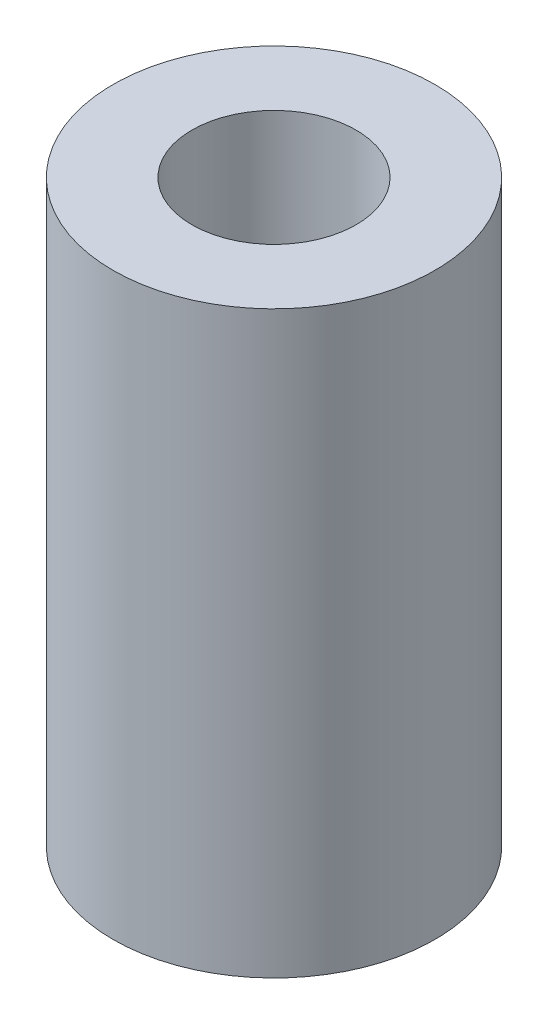
ISO-10303-21;
HEADER;
FILE_DESCRIPTION(('STEP AP214'),'2;1');
FILE_NAME('part.step','',(''),(''),'','','');
FILE_SCHEMA(('AUTOMOTIVE_DESIGN { 1 0 10303 214 1 1 1 1 }'));
ENDSEC;
DATA;
#1=APPLICATION_CONTEXT('core data for automotive mechanical design processes');
#2=APPLICATION_PROTOCOL_DEFINITION('international standard','automotive_design',2000,#1);
#3=PRODUCT_CONTEXT('',#1,'mechanical');
#4=PRODUCT('Part','Part','',(#3));
#5=PRODUCT_RELATED_PRODUCT_CATEGORY('part','',(#4));
#6=PRODUCT_DEFINITION_FORMATION('','',#4);
#7=PRODUCT_DEFINITION_CONTEXT('part definition',#1,'design');
#8=PRODUCT_DEFINITION('design','',#6,#7);
#9=PRODUCT_DEFINITION_SHAPE('','',#8);
#10=(LENGTH_UNIT() NAMED_UNIT(*) SI_UNIT(.MILLI.,.METRE.));
#11=(NAMED_UNIT(*) PLANE_ANGLE_UNIT() SI_UNIT($,.RADIAN.));
#12=(NAMED_UNIT(*) SI_UNIT($,.STERADIAN.) SOLID_ANGLE_UNIT());
#13=UNCERTAINTY_MEASURE_WITH_UNIT(LENGTH_MEASURE(1.E-05),#10,'distance_accuracy_value','');
#14=(GEOMETRIC_REPRESENTATION_CONTEXT(3) GLOBAL_UNCERTAINTY_ASSIGNED_CONTEXT((#13)) GLOBAL_UNIT_ASSIGNED_CONTEXT((#10,
#11,#12)) REPRESENTATION_CONTEXT('',''));
#15=CARTESIAN_POINT('',(0.,0.,0.));
#16=DIRECTION('',(0.,0.,1.));
#17=DIRECTION('',(1.,0.,0.));
#18=AXIS2_PLACEMENT_3D('',#15,#16,#17);
#19=CARTESIAN_POINT('',(0.,22.86,0.));
#20=DIRECTION('',(0.,-1.,0.));
#21=DIRECTION('',(0.,0.,-1.));
#22=AXIS2_PLACEMENT_3D('',#19,#20,#21);
#23=CYLINDRICAL_SURFACE('',#22,6.35);
#24=CARTESIAN_POINT('',(0.,22.86,0.));
#25=DIRECTION('',(0.,1.,0.));
#26=DIRECTION('',(0.,0.,1.));
#27=AXIS2_PLACEMENT_3D('',#24,#25,#26);
#28=CIRCLE('',#27,6.35);
#29=CARTESIAN_POINT('',(0.,22.86,6.35));
#30=VERTEX_POINT('',#29);
#31=EDGE_CURVE('E10',#30,#30,#28,.T.);
#32=ORIENTED_EDGE('',*,*,#31,.F.);
#33=EDGE_LOOP('',(#32));
#34=FACE_BOUND('',#33,.T.);
#35=CARTESIAN_POINT('',(0.,0.,0.));
#36=DIRECTION('',(0.,1.,0.));
#37=DIRECTION('',(0.,0.,1.));
#38=AXIS2_PLACEMENT_3D('',#35,#36,#37);
#39=CIRCLE('',#38,6.35);
#40=CARTESIAN_POINT('',(0.,0.,6.35));
#41=VERTEX_POINT('',#40);
#42=EDGE_CURVE('E36',#41,#41,#39,.T.);
#43=ORIENTED_EDGE('',*,*,#42,.T.);
#44=EDGE_LOOP('',(#43));
#45=FACE_BOUND('',#44,.T.);
#46=ADVANCED_FACE('F33',(#34,#45),#23,.T.);
#47=CARTESIAN_POINT('',(0.,22.86,0.));
#48=DIRECTION('',(0.,1.,0.));
#49=DIRECTION('',(0.,0.,1.));
#50=AXIS2_PLACEMENT_3D('',#47,#48,#49);
#51=PLANE('',#50);
#52=CARTESIAN_POINT('',(0.,22.86,0.));
#53=DIRECTION('',(0.,1.,0.));
#54=DIRECTION('',(0.,0.,1.));
#55=AXIS2_PLACEMENT_3D('',#52,#53,#54);
#56=CIRCLE('',#55,3.2385);
#57=CARTESIAN_POINT('',(0.,22.86,3.2385));
#58=VERTEX_POINT('',#57);
#59=EDGE_CURVE('E51',#58,#58,#56,.T.);
#60=ORIENTED_EDGE('',*,*,#59,.F.);
#61=EDGE_LOOP('',(#60));
#62=FACE_BOUND('',#61,.T.);
#63=ORIENTED_EDGE('',*,*,#31,.T.);
#64=EDGE_LOOP('',(#63));
#65=FACE_BOUND('',#64,.T.);
#66=ADVANCED_FACE('F66',(#62,#65),#51,.T.);
#67=CARTESIAN_POINT('',(0.,0.,0.));
#68=DIRECTION('',(0.,1.,0.));
#69=DIRECTION('',(0.,0.,1.));
#70=AXIS2_PLACEMENT_3D('',#67,#68,#69);
#71=PLANE('',#70);
#72=CARTESIAN_POINT('',(0.,0.,0.));
#73=DIRECTION('',(0.,-1.,0.));
#74=DIRECTION('',(0.,0.,-1.));
#75=AXIS2_PLACEMENT_3D('',#72,#73,#74);
#76=CIRCLE('',#75,3.048);
#77=CARTESIAN_POINT('',(0.,0.,-3.048));
#78=VERTEX_POINT('',#77);
#79=EDGE_CURVE('E45',#78,#78,#76,.T.);
#80=ORIENTED_EDGE('',*,*,#79,.F.);
#81=EDGE_LOOP('',(#80));
#82=FACE_BOUND('',#81,.T.);
#83=ORIENTED_EDGE('',*,*,#42,.F.);
#84=EDGE_LOOP('',(#83));
#85=FACE_BOUND('',#84,.T.);
#86=ADVANCED_FACE('F68',(#82,#85),#71,.F.);
#87=CARTESIAN_POINT('',(0.,8.636,0.));
#88=DIRECTION('',(0.,-1.,0.));
#89=DIRECTION('',(0.,0.,-1.));
#90=AXIS2_PLACEMENT_3D('',#87,#88,#89);
#91=CYLINDRICAL_SURFACE('',#90,3.048);
#92=CARTESIAN_POINT('',(0.,8.636,0.));
#93=DIRECTION('',(0.,-1.,0.));
#94=DIRECTION('',(0.,0.,-1.));
#95=AXIS2_PLACEMENT_3D('',#92,#93,#94);
#96=CIRCLE('',#95,3.048);
#97=CARTESIAN_POINT('',(0.,8.636,-3.048));
#98=VERTEX_POINT('',#97);
#99=EDGE_CURVE('E43',#98,#98,#96,.T.);
#100=ORIENTED_EDGE('',*,*,#99,.F.);
#101=EDGE_LOOP('',(#100));
#102=FACE_BOUND('',#101,.T.);
#103=ORIENTED_EDGE('',*,*,#79,.T.);
#104=EDGE_LOOP('',(#103));
#105=FACE_BOUND('',#104,.T.);
#106=ADVANCED_FACE('F74',(#102,#105),#91,.F.);
#107=CARTESIAN_POINT('',(0.,8.636,0.));
#108=DIRECTION('',(0.,-1.,0.));
#109=DIRECTION('',(0.,0.,-1.));
#110=AXIS2_PLACEMENT_3D('',#107,#108,#109);
#111=PLANE('',#110);
#112=ORIENTED_EDGE('',*,*,#99,.T.);
#113=EDGE_LOOP('',(#112));
#114=FACE_BOUND('',#113,.T.);
#115=ADVANCED_FACE('F62',(#114),#111,.T.);
#116=CARTESIAN_POINT('',(0.,12.7,0.));
#117=DIRECTION('',(0.,1.,0.));
#118=DIRECTION('',(0.,0.,1.));
#119=AXIS2_PLACEMENT_3D('',#116,#117,#118);
#120=CYLINDRICAL_SURFACE('',#119,3.2385);
#121=CARTESIAN_POINT('',(0.,12.7,0.));
#122=DIRECTION('',(0.,1.,0.));
#123=DIRECTION('',(0.,0.,1.));
#124=AXIS2_PLACEMENT_3D('',#121,#122,#123);
#125=CIRCLE('',#124,3.2385);
#126=CARTESIAN_POINT('',(0.,12.7,3.2385));
#127=VERTEX_POINT('',#126);
#128=EDGE_CURVE('E48',#127,#127,#125,.T.);
#129=ORIENTED_EDGE('',*,*,#128,.F.);
#130=EDGE_LOOP('',(#129));
#131=FACE_BOUND('',#130,.T.);
#132=ORIENTED_EDGE('',*,*,#59,.T.);
#133=EDGE_LOOP('',(#132));
#134=FACE_BOUND('',#133,.T.);
#135=ADVANCED_FACE('F59',(#131,#134),#120,.F.);
#136=CARTESIAN_POINT('',(0.,12.7,0.));
#137=DIRECTION('',(0.,1.,0.));
#138=DIRECTION('',(0.,0.,1.));
#139=AXIS2_PLACEMENT_3D('',#136,#137,#138);
#140=PLANE('',#139);
#141=ORIENTED_EDGE('',*,*,#128,.T.);
#142=EDGE_LOOP('',(#141));
#143=FACE_BOUND('',#142,.T.);
#144=ADVANCED_FACE('F57',(#143),#140,.T.);
#145=CLOSED_SHELL('',(#46,#66,#86,#106,#115,#135,#144));
#146=MANIFOLD_SOLID_BREP('B2',#145);
#147=ADVANCED_BREP_SHAPE_REPRESENTATION('',(#18,#146),#14);
#148=SHAPE_DEFINITION_REPRESENTATION(#9,#147);
ENDSEC;
END-ISO-10303-21;
